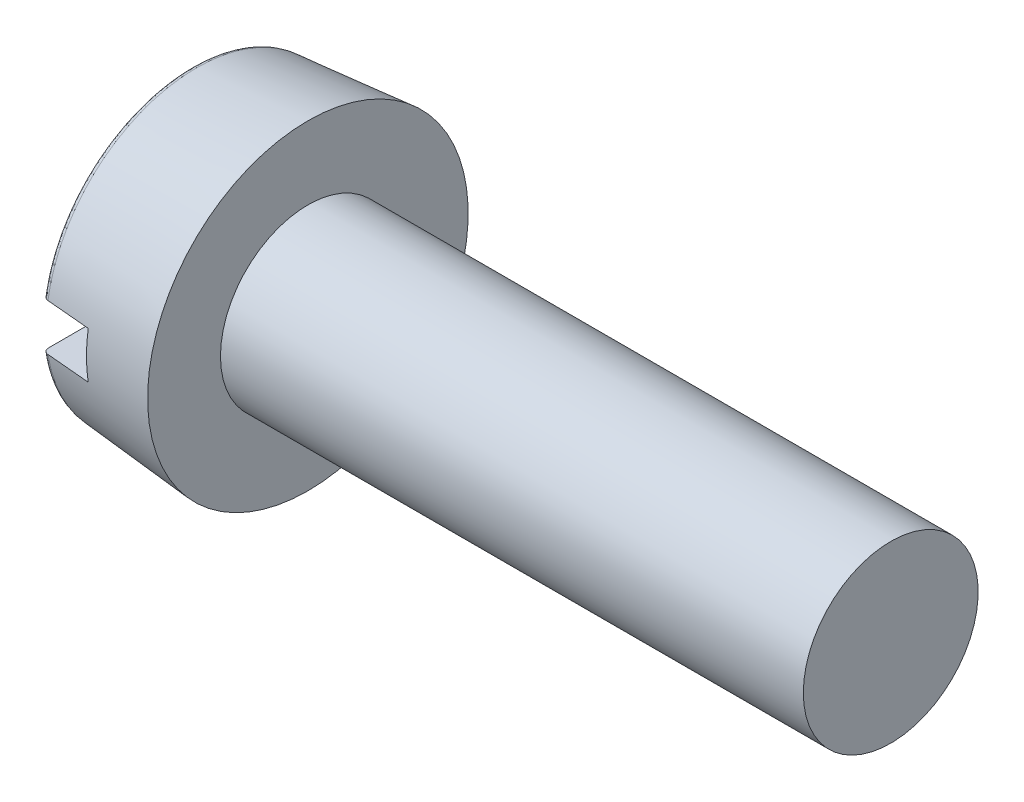
ISO-10303-21;
HEADER;
FILE_DESCRIPTION(('STEP AP214'),'2;1');
FILE_NAME('part.step','',(''),(''),'','','');
FILE_SCHEMA(('AUTOMOTIVE_DESIGN { 1 0 10303 214 1 1 1 1 }'));
ENDSEC;
DATA;
#1=APPLICATION_CONTEXT('core data for automotive mechanical design processes');
#2=APPLICATION_PROTOCOL_DEFINITION('international standard','automotive_design',2000,#1);
#3=PRODUCT_CONTEXT('',#1,'mechanical');
#4=PRODUCT('Part','Part','',(#3));
#5=PRODUCT_RELATED_PRODUCT_CATEGORY('part','',(#4));
#6=PRODUCT_DEFINITION_FORMATION('','',#4);
#7=PRODUCT_DEFINITION_CONTEXT('part definition',#1,'design');
#8=PRODUCT_DEFINITION('design','',#6,#7);
#9=PRODUCT_DEFINITION_SHAPE('','',#8);
#10=(LENGTH_UNIT() NAMED_UNIT(*) SI_UNIT(.MILLI.,.METRE.));
#11=(NAMED_UNIT(*) PLANE_ANGLE_UNIT() SI_UNIT($,.RADIAN.));
#12=(NAMED_UNIT(*) SI_UNIT($,.STERADIAN.) SOLID_ANGLE_UNIT());
#13=UNCERTAINTY_MEASURE_WITH_UNIT(LENGTH_MEASURE(1.E-05),#10,'distance_accuracy_value','');
#14=(GEOMETRIC_REPRESENTATION_CONTEXT(3) GLOBAL_UNCERTAINTY_ASSIGNED_CONTEXT((#13)) GLOBAL_UNIT_ASSIGNED_CONTEXT((#10,
#11,#12)) REPRESENTATION_CONTEXT('',''));
#15=CARTESIAN_POINT('',(0.,0.,0.));
#16=DIRECTION('',(0.,0.,1.));
#17=DIRECTION('',(1.,0.,0.));
#18=AXIS2_PLACEMENT_3D('',#15,#16,#17);
#19=CARTESIAN_POINT('',(0.,-0.4,2.650446542));
#20=DIRECTION('',(0.,-1.,0.));
#21=DIRECTION('',(0.,0.,-1.));
#22=AXIS2_PLACEMENT_3D('',#19,#20,#21);
#23=PLANE('',#22);
#24=CARTESIAN_POINT('',(-3.88264754801787E-10,-0.4,-2.45096382721289));
#25=CARTESIAN_POINT('',(8.23469277590213E-07,-0.400000000000683,-2.45672147849652));
#26=CARTESIAN_POINT('',(0.000485740539162257,-0.400000000000431,-2.46246889609489));
#27=CARTESIAN_POINT('',(0.00240753486794676,-0.399999999999569,-2.47380010316481));
#28=CARTESIAN_POINT('',(0.00384409442476151,-0.399999999998958,-2.47938394659553));
#29=CARTESIAN_POINT('',(0.00954542054326699,-0.399999999998849,-2.49564714861891));
#30=CARTESIAN_POINT('',(0.0152020603181267,-0.400000000001058,-2.50587617527297));
#31=CARTESIAN_POINT('',(0.0295560275156081,-0.399999999998943,-2.52377256067412));
#32=CARTESIAN_POINT('',(0.0382333783044966,-0.399999999994662,-2.53145611716201));
#33=CARTESIAN_POINT('',(0.0575844854018703,-0.399999999994604,-2.54337606647098));
#34=CARTESIAN_POINT('',(0.0682327265056606,-0.399999999998725,-2.54765317542582));
#35=CARTESIAN_POINT('',(0.0832192883416446,-0.400000000000461,-2.5508884248263));
#36=CARTESIAN_POINT('',(0.0872441554275944,-0.40000000000055,-2.55149900085297));
#37=CARTESIAN_POINT('',(0.0912844258242664,-0.399999999999937,-2.55184945172854));
#38=B_SPLINE_CURVE_WITH_KNOTS('',3,(#24,#25,#26,#27,#28,#29,#30,#31,#32,#33,#34,#35,#36,#37),
.UNSPECIFIED.,.F.,.F.,(4,2,2,2,2,2,4),(0.,0.0172324601899396,0.0344591702884396,
0.0688041676320151,0.102926218379292,0.13663402778301,0.148813672108883),.UNSPECIFIED.);
#39=CARTESIAN_POINT('',(-1.55305900850545E-10,-0.400000000229972,-2.45096382721289));
#40=VERTEX_POINT('',#39);
#41=CARTESIAN_POINT('',(0.0912844259120966,-0.399999999999968,-2.5518494516251));
#42=VERTEX_POINT('',#41);
#43=EDGE_CURVE('E100',#40,#42,#38,.T.);
#44=ORIENTED_EDGE('',*,*,#43,.F.);
#45=DIRECTION('',(0.,0.,-1.));
#46=VECTOR('',#45,1.);
#47=CARTESIAN_POINT('',(0.,-0.4,0.));
#48=LINE('',#47,#46);
#49=CARTESIAN_POINT('',(-1.55305900850545E-10,-0.400000000229972,2.45096382721289));
#50=VERTEX_POINT('',#49);
#51=EDGE_CURVE('E93',#50,#40,#48,.T.);
#52=ORIENTED_EDGE('',*,*,#51,.F.);
#53=CARTESIAN_POINT('',(0.0912844258227498,-0.4,2.5518494517284));
#54=CARTESIAN_POINT('',(0.0857148648744234,-0.400000000000016,2.55135621638075));
#55=CARTESIAN_POINT('',(0.0801975998035407,-0.400000000000008,2.5503899754913));
#56=CARTESIAN_POINT('',(0.069409338122753,-0.399999999999992,2.54754766453578));
#57=CARTESIAN_POINT('',(0.0641380702907059,-0.399999999999985,2.54567262374717));
#58=CARTESIAN_POINT('',(0.0489193196515725,-0.400000000000031,2.53875010258025));
#59=CARTESIAN_POINT('',(0.0395291097761964,-0.400000000000155,2.53240156020649));
#60=CARTESIAN_POINT('',(0.0233108199671268,-0.399999999999848,2.51695392511927));
#61=CARTESIAN_POINT('',(0.0164994426360841,-0.399999999999413,2.50783756819865));
#62=CARTESIAN_POINT('',(0.00615284354292489,-0.399999999999386,2.48774464580124));
#63=CARTESIAN_POINT('',(0.00265801971679152,-0.399999999999802,2.47674702132579));
#64=CARTESIAN_POINT('',(0.000340734068961633,-0.400000000000085,2.46069313066721));
#65=CARTESIAN_POINT('',(-9.49251235962126E-06,-0.40000000000013,2.45582329079742));
#66=CARTESIAN_POINT('',(-3.88264754859766E-10,-0.400000000000083,2.45096382721327));
#67=B_SPLINE_CURVE_WITH_KNOTS('',3,(#53,#54,#55,#56,#57,#58,#59,#60,#61,#62,#63,#64,#65,#66),
.UNSPECIFIED.,.F.,.F.,(4,2,2,2,2,2,4),(0.,0.0167339512516012,0.0334489942994423,
0.0667708029238235,0.100304881525151,0.134242375441344,0.148836154643942),.UNSPECIFIED.);
#68=CARTESIAN_POINT('',(0.0912844259211104,-0.4,2.55184945151469));
#69=VERTEX_POINT('',#68);
#70=EDGE_CURVE('E79',#69,#50,#67,.T.);
#71=ORIENTED_EDGE('',*,*,#70,.F.);
#72=CARTESIAN_POINT('',(0.850000000094597,-0.400000000175783,2.619018321802));
#73=CARTESIAN_POINT('',(0.72354710573568,-0.400000000087891,2.60782688353553));
#74=CARTESIAN_POINT('',(0.597094360702005,-0.400000000029297,2.59663375854446));
#75=CARTESIAN_POINT('',(0.344189169284567,-0.399999999970703,2.57424413511303));
#76=CARTESIAN_POINT('',(0.217736722900805,-0.399999999970703,2.56304763667267));
#77=CARTESIAN_POINT('',(0.0912844258422845,-0.4,2.5518494515077));
#78=B_SPLINE_CURVE_WITH_KNOTS('',3,(#72,#73,#74,#75,#76,#77),.UNSPECIFIED.,.F.,.F.,(4,2,4),(0.,
0.380841495851696,0.761682991705114),.UNSPECIFIED.);
#79=CARTESIAN_POINT('',(0.850000000275011,-0.4,2.61901832166631));
#80=VERTEX_POINT('',#79);
#81=EDGE_CURVE('E21',#80,#69,#78,.T.);
#82=ORIENTED_EDGE('',*,*,#81,.F.);
#83=DIRECTION('',(0.,0.,-1.));
#84=VECTOR('',#83,1.);
#85=CARTESIAN_POINT('',(0.85,-0.4,0.));
#86=LINE('',#85,#84);
#87=CARTESIAN_POINT('',(0.850000000275822,-0.4,-2.61901832166638));
#88=VERTEX_POINT('',#87);
#89=EDGE_CURVE('E77',#80,#88,#86,.T.);
#90=ORIENTED_EDGE('',*,*,#89,.T.);
#91=CARTESIAN_POINT('',(0.0912844258327621,-0.400000000147707,-2.55184945163379));
#92=CARTESIAN_POINT('',(0.217736722894637,-0.400000000073854,-2.56304763676087));
#93=CARTESIAN_POINT('',(0.344189169282115,-0.400000000024618,-2.57424413515924));
#94=CARTESIAN_POINT('',(0.597094360707707,-0.399999999975382,-2.59663375849853));
#95=CARTESIAN_POINT('',(0.723547105745822,-0.399999999975382,-2.60782688343945));
#96=CARTESIAN_POINT('',(0.85000000010954,-0.4,-2.61901832165167));
#97=B_SPLINE_CURVE_WITH_KNOTS('',3,(#91,#92,#93,#94,#95,#96),.UNSPECIFIED.,.F.,.F.,(4,2,4),(0.,
0.380841495853413,0.761682991705108),.UNSPECIFIED.);
#98=EDGE_CURVE('E97',#42,#88,#97,.T.);
#99=ORIENTED_EDGE('',*,*,#98,.F.);
#100=EDGE_LOOP('',(#44,#52,#71,#82,#90,#99));
#101=FACE_BOUND('',#100,.T.);
#102=ADVANCED_FACE('F17',(#101),#23,.F.);
#103=CARTESIAN_POINT('',(0.85,-0.4,2.681180693));
#104=DIRECTION('',(1.,0.,0.));
#105=DIRECTION('',(0.,0.,-1.));
#106=AXIS2_PLACEMENT_3D('',#103,#104,#105);
#107=PLANE('',#106);
#108=CARTESIAN_POINT('',(0.850000000442108,0.,0.));
#109=DIRECTION('',(1.,0.,0.));
#110=DIRECTION('',(0.,1.,0.));
#111=AXIS2_PLACEMENT_3D('',#108,#109,#110);
#112=CIRCLE('',#111,2.64938803675514);
#113=CARTESIAN_POINT('',(0.850000000255486,0.4,2.61901832166458));
#114=VERTEX_POINT('',#113);
#115=EDGE_CURVE('E84',#114,#80,#112,.T.);
#116=ORIENTED_EDGE('',*,*,#115,.F.);
#117=DIRECTION('',(0.,0.,-1.));
#118=VECTOR('',#117,1.);
#119=CARTESIAN_POINT('',(0.85,0.4,0.));
#120=LINE('',#119,#118);
#121=CARTESIAN_POINT('',(0.850000000221054,0.4,-2.61901832166153));
#122=VERTEX_POINT('',#121);
#123=EDGE_CURVE('E104',#114,#122,#120,.T.);
#124=ORIENTED_EDGE('',*,*,#123,.T.);
#125=CARTESIAN_POINT('',(0.850000000442108,0.,0.));
#126=DIRECTION('',(1.,0.,0.));
#127=DIRECTION('',(0.,1.,0.));
#128=AXIS2_PLACEMENT_3D('',#125,#126,#127);
#129=CIRCLE('',#128,2.64938803675514);
#130=EDGE_CURVE('E94',#88,#122,#129,.T.);
#131=ORIENTED_EDGE('',*,*,#130,.F.);
#132=ORIENTED_EDGE('',*,*,#89,.F.);
#133=EDGE_LOOP('',(#116,#124,#131,#132));
#134=FACE_BOUND('',#133,.T.);
#135=ADVANCED_FACE('F96',(#134),#107,.F.);
#136=CARTESIAN_POINT('',(0.,-2.495889893,-2.480375394));
#137=DIRECTION('',(-1.,0.,0.));
#138=DIRECTION('',(0.,0.,1.));
#139=AXIS2_PLACEMENT_3D('',#136,#137,#138);
#140=PLANE('',#139);
#141=ORIENTED_EDGE('',*,*,#51,.T.);
#142=CARTESIAN_POINT('',(-3.88264752088621E-10,-0.342851183630537,2.45960906493691));
#143=CARTESIAN_POINT('',(-3.8826475132627E-10,-4.1607756227118,1.9274188353991));
#144=CARTESIAN_POINT('',(-3.8826475132627E-10,-4.1607756227118,-1.9274188353991));
#145=CARTESIAN_POINT('',(-3.88264752088621E-10,-0.342851183630537,-2.45960906493691));
#146=(BOUNDED_CURVE() B_SPLINE_CURVE(3,(#142,#143,#144,#145),.UNSPECIFIED.,.F.,
.F.) B_SPLINE_CURVE_WITH_KNOTS((4,4),(0.,1.),
.UNSPECIFIED.) CURVE() GEOMETRIC_REPRESENTATION_ITEM() RATIONAL_B_SPLINE_CURVE((0.95905674209149,
0.407955726950188,0.407955726950188,0.95905674209149)) REPRESENTATION_ITEM(''));
#147=EDGE_CURVE('E111',#50,#40,#146,.T.);
#148=ORIENTED_EDGE('',*,*,#147,.F.);
#149=EDGE_LOOP('',(#141,#148));
#150=FACE_BOUND('',#149,.T.);
#151=ADVANCED_FACE('F118',(#150),#140,.T.);
#152=CARTESIAN_POINT('',(0.,0.4,-2.650446542));
#153=DIRECTION('',(0.,1.,0.));
#154=DIRECTION('',(0.,0.,1.));
#155=AXIS2_PLACEMENT_3D('',#152,#153,#154);
#156=PLANE('',#155);
#157=ORIENTED_EDGE('',*,*,#123,.F.);
#158=CARTESIAN_POINT('',(0.09128442584827,0.399999999997224,2.55184945150585));
#159=CARTESIAN_POINT('',(0.217736722896994,0.399999999998612,2.56304763669642));
#160=CARTESIAN_POINT('',(0.344189169273215,0.399999999999537,2.5742441351369));
#161=CARTESIAN_POINT('',(0.597094360680079,0.400000000000463,2.59663375851764));
#162=CARTESIAN_POINT('',(0.723547105710723,0.400000000000463,2.60782688345789));
#163=CARTESIAN_POINT('',(0.850000000068864,0.4,2.61901832164807));
#164=B_SPLINE_CURVE_WITH_KNOTS('',3,(#158,#159,#160,#161,#162,#163),.UNSPECIFIED.,.F.,.F.,(4,2,
4),(0.,0.380841495830915,0.76168299166011),.UNSPECIFIED.);
#165=CARTESIAN_POINT('',(0.0912844259141692,0.399999999999969,2.55184945162529));
#166=VERTEX_POINT('',#165);
#167=EDGE_CURVE('E89',#166,#114,#164,.T.);
#168=ORIENTED_EDGE('',*,*,#167,.F.);
#169=CARTESIAN_POINT('',(-3.88264754899792E-10,0.4,2.45096382721288));
#170=CARTESIAN_POINT('',(8.23469276589504E-07,0.400000000000683,2.4567214784965));
#171=CARTESIAN_POINT('',(0.00048574053916007,0.400000000000431,2.46246889609487));
#172=CARTESIAN_POINT('',(0.00240753486794207,0.399999999999569,2.47380010316479));
#173=CARTESIAN_POINT('',(0.00384409442475547,0.399999999998958,2.47938394659551));
#174=CARTESIAN_POINT('',(0.00954542054325717,0.399999999998849,2.4956471486189));
#175=CARTESIAN_POINT('',(0.0152020603181147,0.400000000001058,2.50587617527295));
#176=CARTESIAN_POINT('',(0.029556027515593,0.399999999998943,2.52377256067411));
#177=CARTESIAN_POINT('',(0.0382333783044807,0.399999999994662,2.531456117162));
#178=CARTESIAN_POINT('',(0.0575844854018479,0.399999999994604,2.54337606647098));
#179=CARTESIAN_POINT('',(0.0682327265056326,0.399999999998725,2.54765317542581));
#180=CARTESIAN_POINT('',(0.0832192883429883,0.400000000000461,2.5508884248266));
#181=CARTESIAN_POINT('',(0.0872441554303379,0.40000000000055,2.5514990008534));
#182=CARTESIAN_POINT('',(0.0912844258284116,0.399999999999937,2.55184945172891));
#183=B_SPLINE_CURVE_WITH_KNOTS('',3,(#169,#170,#171,#172,#173,#174,#175,#176,#177,#178,#179,
#180,#181,#182),.UNSPECIFIED.,.F.,.F.,(4,2,2,2,2,2,4),(0.,0.0172324601899393,0.0344591702884387,
0.0688041676320139,0.10292621837929,0.136634027783007,0.148813672113057),.UNSPECIFIED.);
#184=CARTESIAN_POINT('',(-1.55305900841723E-10,0.400000000230091,2.45096382721288));
#185=VERTEX_POINT('',#184);
#186=EDGE_CURVE('E41',#185,#166,#183,.T.);
#187=ORIENTED_EDGE('',*,*,#186,.F.);
#188=DIRECTION('',(0.,0.,1.));
#189=VECTOR('',#188,1.);
#190=CARTESIAN_POINT('',(0.,0.4,0.));
#191=LINE('',#190,#189);
#192=CARTESIAN_POINT('',(-1.55305900841723E-10,0.400000000230092,-2.45096382721288));
#193=VERTEX_POINT('',#192);
#194=EDGE_CURVE('E189',#193,#185,#191,.T.);
#195=ORIENTED_EDGE('',*,*,#194,.F.);
#196=CARTESIAN_POINT('',(0.0912844258256326,0.4,-2.55184945172866));
#197=CARTESIAN_POINT('',(0.0857148648772951,0.400000000000016,-2.55135621638117));
#198=CARTESIAN_POINT('',(0.0801975998063876,0.400000000000008,-2.55038997549189));
#199=CARTESIAN_POINT('',(0.0694093381255233,0.399999999999992,-2.54754766453668));
#200=CARTESIAN_POINT('',(0.0641380702934247,0.399999999999985,-2.54567262374823));
#201=CARTESIAN_POINT('',(0.0489193196540978,0.400000000000032,-2.53875010258176));
#202=CARTESIAN_POINT('',(0.0395291097785408,0.400000000000155,-2.53240156020827));
#203=CARTESIAN_POINT('',(0.0233108199690319,0.399999999999848,-2.51695392512154));
#204=CARTESIAN_POINT('',(0.0164994426377294,0.399999999999414,-2.50783756820113));
#205=CARTESIAN_POINT('',(0.00615284354399601,0.399999999999385,-2.48774464580404));
#206=CARTESIAN_POINT('',(0.00265801971754725,0.399999999999801,-2.47674702132872));
#207=CARTESIAN_POINT('',(0.000340734069101161,0.400000000000085,-2.4606931306692));
#208=CARTESIAN_POINT('',(-9.49251236520458E-06,0.40000000000013,-2.45582329079841));
#209=CARTESIAN_POINT('',(-3.8826475501002E-10,0.400000000000084,-2.45096382721325));
#210=B_SPLINE_CURVE_WITH_KNOTS('',3,(#196,#197,#198,#199,#200,#201,#202,#203,#204,#205,#206,
#207,#208,#209),.UNSPECIFIED.,.F.,.F.,(4,2,2,2,2,2,4),(0.,0.0167339512515908,0.0334489942994217,
0.066770802923782,0.100304881525078,0.134242375441233,0.14883615464685),.UNSPECIFIED.);
#211=CARTESIAN_POINT('',(0.0912844259225519,0.4,-2.55184945151482));
#212=VERTEX_POINT('',#211);
#213=EDGE_CURVE('E156',#212,#193,#210,.T.);
#214=ORIENTED_EDGE('',*,*,#213,.F.);
#215=CARTESIAN_POINT('',(0.850000000073007,0.4,-2.61901832164843));
#216=CARTESIAN_POINT('',(0.723547105713729,0.4,-2.60782688345776));
#217=CARTESIAN_POINT('',(0.597094360681914,0.4,-2.5966337585174));
#218=CARTESIAN_POINT('',(0.344189169272636,0.4,-2.57424413513724));
#219=CARTESIAN_POINT('',(0.217736722895173,0.4,-2.56304763669745));
#220=CARTESIAN_POINT('',(0.0912844258451723,0.4,-2.55184945150796));
#221=B_SPLINE_CURVE_WITH_KNOTS('',3,(#215,#216,#217,#218,#219,#220),.UNSPECIFIED.,.F.,.F.,(4,2,
4),(0.,0.380841495832725,0.761682991667168),.UNSPECIFIED.);
#222=EDGE_CURVE('E137',#122,#212,#221,.T.);
#223=ORIENTED_EDGE('',*,*,#222,.F.);
#224=EDGE_LOOP('',(#157,#168,#187,#195,#214,#223));
#225=FACE_BOUND('',#224,.T.);
#226=ADVANCED_FACE('F128',(#225),#156,.F.);
#227=CARTESIAN_POINT('',(0.000499583,-0.341472906,-2.449721322));
#228=CARTESIAN_POINT('',(0.000499583,-4.144049111,-1.919670522));
#229=CARTESIAN_POINT('',(0.000499583,-4.144049111,1.919670522));
#230=CARTESIAN_POINT('',(0.000499583,-0.341472906,2.449721322));
#231=CARTESIAN_POINT('',(-0.005885351,-0.3502584,-2.512748324));
#232=CARTESIAN_POINT('',(-0.005885351,-4.250668174,-1.969060253));
#233=CARTESIAN_POINT('',(-0.005885351,-4.250668174,1.969060253));
#234=CARTESIAN_POINT('',(-0.005885351,-0.3502584,2.512748324));
#235=CARTESIAN_POINT('',(0.037322619,-0.356768269,-2.559450018));
#236=CARTESIAN_POINT('',(0.037322619,-4.329670676,-2.005657014));
#237=CARTESIAN_POINT('',(0.037322619,-4.329670676,2.005657014));
#238=CARTESIAN_POINT('',(0.037322619,-0.356768269,2.559450018));
#239=CARTESIAN_POINT('',(0.101273319,-0.356655839,-2.558643453));
#240=CARTESIAN_POINT('',(0.101273319,-4.328306259,-2.005024967));
#241=CARTESIAN_POINT('',(0.101273319,-4.328306259,2.005024967));
#242=CARTESIAN_POINT('',(0.101273319,-0.356655839,2.558643453));
#243=(BOUNDED_SURFACE() B_SPLINE_SURFACE(3,3,((#227,#228,#229,#230),(#231,#232,#233,#234),(#235,
#236,#237,#238),(#239,#240,#241,#242)),.UNSPECIFIED.,.F.,.F.,
.F.) B_SPLINE_SURFACE_WITH_KNOTS((4,4),(4,4),(0.,1.),(0.,1.),
.UNSPECIFIED.) GEOMETRIC_REPRESENTATION_ITEM() RATIONAL_B_SPLINE_SURFACE(((1.,0.425371835727391,
0.425371835727391,1.),(0.77743169494117,0.330697547229782,0.330697547229782,0.77743169494117),
(0.77743169494117,0.330697547229782,0.330697547229782,0.77743169494117),(1.,0.425371835727391,
0.425371835727391,1.))) REPRESENTATION_ITEM('') SURFACE());
#244=CARTESIAN_POINT('',(0.0912844259999268,0.,0.));
#245=DIRECTION('',(1.,0.,0.));
#246=DIRECTION('',(0.,0.,-1.));
#247=AXIS2_PLACEMENT_3D('',#244,#245,#246);
#248=CIRCLE('',#247,2.583009025);
#249=EDGE_CURVE('E181',#42,#69,#248,.F.);
#250=ORIENTED_EDGE('',*,*,#70,.T.);
#251=ORIENTED_EDGE('',*,*,#147,.T.);
#252=ORIENTED_EDGE('',*,*,#43,.T.);
#253=ORIENTED_EDGE('',*,*,#249,.T.);
#254=EDGE_LOOP('',(#250,#251,#252,#253));
#255=FACE_BOUND('',#254,.T.);
#256=ADVANCED_FACE('F132',(#255),#243,.T.);
#257=CARTESIAN_POINT('',(12.,-1.518,1.518));
#258=DIRECTION('',(1.,0.,0.));
#259=DIRECTION('',(0.,0.,-1.));
#260=AXIS2_PLACEMENT_3D('',#257,#258,#259);
#261=PLANE('',#260);
#262=CARTESIAN_POINT('',(12.,0.,0.));
#263=DIRECTION('',(-1.,0.,0.));
#264=DIRECTION('',(0.,0.,1.));
#265=AXIS2_PLACEMENT_3D('',#262,#263,#264);
#266=CIRCLE('',#265,1.5);
#267=CARTESIAN_POINT('',(12.,0.,1.5));
#268=VERTEX_POINT('',#267);
#269=EDGE_CURVE('E188',#268,#268,#266,.F.);
#270=ORIENTED_EDGE('',*,*,#269,.T.);
#271=EDGE_LOOP('',(#270));
#272=FACE_BOUND('',#271,.T.);
#273=ADVANCED_FACE('F133',(#272),#261,.T.);
#274=CARTESIAN_POINT('',(0.,0.4,-2.480375394));
#275=DIRECTION('',(-1.,0.,0.));
#276=DIRECTION('',(0.,0.,1.));
#277=AXIS2_PLACEMENT_3D('',#274,#275,#276);
#278=PLANE('',#277);
#279=ORIENTED_EDGE('',*,*,#194,.T.);
#280=CARTESIAN_POINT('',(-3.88264752064926E-10,0.342851183630537,-2.45960906493691));
#281=CARTESIAN_POINT('',(-3.88264751740256E-10,4.1607756227118,-1.9274188353991));
#282=CARTESIAN_POINT('',(-3.88264751740256E-10,4.1607756227118,1.9274188353991));
#283=CARTESIAN_POINT('',(-3.88264752064926E-10,0.342851183630537,2.45960906493691));
#284=(BOUNDED_CURVE() B_SPLINE_CURVE(3,(#280,#281,#282,#283),.UNSPECIFIED.,.F.,
.F.) B_SPLINE_CURVE_WITH_KNOTS((4,4),(0.,1.),
.UNSPECIFIED.) CURVE() GEOMETRIC_REPRESENTATION_ITEM() RATIONAL_B_SPLINE_CURVE((0.959056742091488,
0.407955726952357,0.407955726952357,0.959056742091488)) REPRESENTATION_ITEM(''));
#285=EDGE_CURVE('E233',#193,#185,#284,.T.);
#286=ORIENTED_EDGE('',*,*,#285,.F.);
#287=EDGE_LOOP('',(#279,#286));
#288=FACE_BOUND('',#287,.T.);
#289=ADVANCED_FACE('F242',(#288),#278,.T.);
#290=CARTESIAN_POINT('',(12.,0.,0.));
#291=DIRECTION('',(-1.,0.,0.));
#292=DIRECTION('',(0.,0.,1.));
#293=AXIS2_PLACEMENT_3D('',#290,#291,#292);
#294=CYLINDRICAL_SURFACE('',#293,1.5);
#295=CARTESIAN_POINT('',(2.,0.,0.));
#296=DIRECTION('',(-1.,0.,0.));
#297=DIRECTION('',(0.,0.,1.));
#298=AXIS2_PLACEMENT_3D('',#295,#296,#297);
#299=CIRCLE('',#298,1.5);
#300=CARTESIAN_POINT('',(2.,0.,1.5));
#301=VERTEX_POINT('',#300);
#302=EDGE_CURVE('E231',#301,#301,#299,.F.);
#303=ORIENTED_EDGE('',*,*,#302,.T.);
#304=EDGE_LOOP('',(#303));
#305=FACE_BOUND('',#304,.T.);
#306=ORIENTED_EDGE('',*,*,#269,.F.);
#307=EDGE_LOOP('',(#306));
#308=FACE_BOUND('',#307,.T.);
#309=ADVANCED_FACE('F163',(#305,#308),#294,.T.);
#310=CARTESIAN_POINT('',(0.000499583,0.341472906,2.449721322));
#311=CARTESIAN_POINT('',(0.000499583,4.144049111,1.919670522));
#312=CARTESIAN_POINT('',(0.000499583,4.144049111,-1.919670522));
#313=CARTESIAN_POINT('',(0.000499583,0.341472906,-2.449721322));
#314=CARTESIAN_POINT('',(-0.005885351,0.3502584,2.512748324));
#315=CARTESIAN_POINT('',(-0.005885351,4.250668174,1.969060253));
#316=CARTESIAN_POINT('',(-0.005885351,4.250668174,-1.969060253));
#317=CARTESIAN_POINT('',(-0.005885351,0.3502584,-2.512748324));
#318=CARTESIAN_POINT('',(0.037322619,0.356768269,2.559450018));
#319=CARTESIAN_POINT('',(0.037322619,4.329670676,2.005657014));
#320=CARTESIAN_POINT('',(0.037322619,4.329670676,-2.005657014));
#321=CARTESIAN_POINT('',(0.037322619,0.356768269,-2.559450018));
#322=CARTESIAN_POINT('',(0.101273319,0.356655839,2.558643453));
#323=CARTESIAN_POINT('',(0.101273319,4.328306259,2.005024967));
#324=CARTESIAN_POINT('',(0.101273319,4.328306259,-2.005024967));
#325=CARTESIAN_POINT('',(0.101273319,0.356655839,-2.558643453));
#326=(BOUNDED_SURFACE() B_SPLINE_SURFACE(3,3,((#310,#311,#312,#313),(#314,#315,#316,#317),(#318,
#319,#320,#321),(#322,#323,#324,#325)),.UNSPECIFIED.,.F.,.F.,
.F.) B_SPLINE_SURFACE_WITH_KNOTS((4,4),(4,4),(0.,1.),(0.,1.),
.UNSPECIFIED.) GEOMETRIC_REPRESENTATION_ITEM() RATIONAL_B_SPLINE_SURFACE(((1.,0.425371835729653,
0.425371835729653,1.),(0.77743169494117,0.330697547231541,0.330697547231541,0.77743169494117),
(0.77743169494117,0.330697547231541,0.330697547231541,0.77743169494117),(1.,0.425371835729653,
0.425371835729653,1.))) REPRESENTATION_ITEM('') SURFACE());
#327=CARTESIAN_POINT('',(0.0912844259999268,0.,0.));
#328=DIRECTION('',(1.,0.,0.));
#329=DIRECTION('',(0.,0.,-1.));
#330=AXIS2_PLACEMENT_3D('',#327,#328,#329);
#331=CIRCLE('',#330,2.583009025);
#332=EDGE_CURVE('E32',#166,#212,#331,.F.);
#333=ORIENTED_EDGE('',*,*,#186,.T.);
#334=ORIENTED_EDGE('',*,*,#332,.T.);
#335=ORIENTED_EDGE('',*,*,#213,.T.);
#336=ORIENTED_EDGE('',*,*,#285,.T.);
#337=EDGE_LOOP('',(#333,#334,#335,#336));
#338=FACE_BOUND('',#337,.T.);
#339=ADVANCED_FACE('F157',(#338),#326,.T.);
#340=CARTESIAN_POINT('',(2.,-2.783,-2.783));
#341=DIRECTION('',(-1.,0.,0.));
#342=DIRECTION('',(0.,0.,1.));
#343=AXIS2_PLACEMENT_3D('',#340,#341,#342);
#344=PLANE('',#343);
#345=ORIENTED_EDGE('',*,*,#302,.F.);
#346=EDGE_LOOP('',(#345));
#347=FACE_BOUND('',#346,.T.);
#348=CARTESIAN_POINT('',(2.,0.,0.));
#349=DIRECTION('',(1.,0.,0.));
#350=DIRECTION('',(0.,1.,0.));
#351=AXIS2_PLACEMENT_3D('',#348,#349,#350);
#352=CIRCLE('',#351,2.75);
#353=CARTESIAN_POINT('',(2.,2.75,0.));
#354=VERTEX_POINT('',#353);
#355=EDGE_CURVE('E11',#354,#354,#352,.T.);
#356=ORIENTED_EDGE('',*,*,#355,.T.);
#357=EDGE_LOOP('',(#356));
#358=FACE_BOUND('',#357,.T.);
#359=ADVANCED_FACE('F19',(#347,#358),#344,.F.);
#360=CARTESIAN_POINT('',(0.091284426,0.,0.));
#361=DIRECTION('',(1.,0.,0.));
#362=DIRECTION('',(0.,1.,0.));
#363=AXIS2_PLACEMENT_3D('',#360,#361,#362);
#364=CONICAL_SURFACE('',#363,2.583009025,0.0872664627970948);
#365=ORIENTED_EDGE('',*,*,#98,.T.);
#366=ORIENTED_EDGE('',*,*,#130,.T.);
#367=ORIENTED_EDGE('',*,*,#222,.T.);
#368=ORIENTED_EDGE('',*,*,#332,.F.);
#369=ORIENTED_EDGE('',*,*,#167,.T.);
#370=ORIENTED_EDGE('',*,*,#115,.T.);
#371=ORIENTED_EDGE('',*,*,#81,.T.);
#372=ORIENTED_EDGE('',*,*,#249,.F.);
#373=EDGE_LOOP('',(#365,#366,#367,#368,#369,#370,#371,#372));
#374=FACE_BOUND('',#373,.T.);
#375=ORIENTED_EDGE('',*,*,#355,.F.);
#376=EDGE_LOOP('',(#375));
#377=FACE_BOUND('',#376,.T.);
#378=ADVANCED_FACE('F86',(#374,#377),#364,.T.);
#379=CLOSED_SHELL('',(#102,#135,#151,#226,#256,#273,#289,#309,#339,#359,#378));
#380=MANIFOLD_SOLID_BREP('B1',#379);
#381=ADVANCED_BREP_SHAPE_REPRESENTATION('',(#18,#380),#14);
#382=SHAPE_DEFINITION_REPRESENTATION(#9,#381);
ENDSEC;
END-ISO-10303-21;
